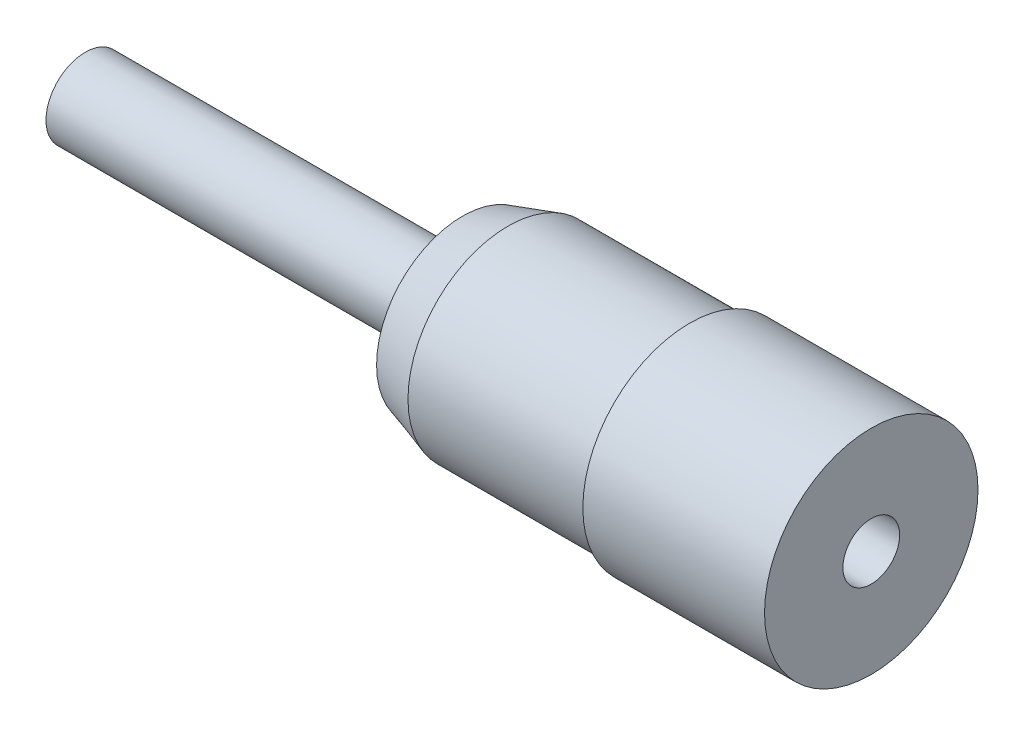
ISO-10303-21;
HEADER;
FILE_DESCRIPTION(('STEP AP214'),'2;1');
FILE_NAME('part.step','',(''),(''),'','','');
FILE_SCHEMA(('AUTOMOTIVE_DESIGN { 1 0 10303 214 1 1 1 1 }'));
ENDSEC;
DATA;
#1=APPLICATION_CONTEXT('core data for automotive mechanical design processes');
#2=APPLICATION_PROTOCOL_DEFINITION('international standard','automotive_design',2000,#1);
#3=PRODUCT_CONTEXT('',#1,'mechanical');
#4=PRODUCT('Part','Part','',(#3));
#5=PRODUCT_RELATED_PRODUCT_CATEGORY('part','',(#4));
#6=PRODUCT_DEFINITION_FORMATION('','',#4);
#7=PRODUCT_DEFINITION_CONTEXT('part definition',#1,'design');
#8=PRODUCT_DEFINITION('design','',#6,#7);
#9=PRODUCT_DEFINITION_SHAPE('','',#8);
#10=(LENGTH_UNIT() NAMED_UNIT(*) SI_UNIT(.MILLI.,.METRE.));
#11=(NAMED_UNIT(*) PLANE_ANGLE_UNIT() SI_UNIT($,.RADIAN.));
#12=(NAMED_UNIT(*) SI_UNIT($,.STERADIAN.) SOLID_ANGLE_UNIT());
#13=UNCERTAINTY_MEASURE_WITH_UNIT(LENGTH_MEASURE(1.E-05),#10,'distance_accuracy_value','');
#14=(GEOMETRIC_REPRESENTATION_CONTEXT(3) GLOBAL_UNCERTAINTY_ASSIGNED_CONTEXT((#13)) GLOBAL_UNIT_ASSIGNED_CONTEXT((#10,
#11,#12)) REPRESENTATION_CONTEXT('',''));
#15=CARTESIAN_POINT('',(0.,0.,0.));
#16=DIRECTION('',(0.,0.,1.));
#17=DIRECTION('',(1.,0.,0.));
#18=AXIS2_PLACEMENT_3D('',#15,#16,#17);
#19=CARTESIAN_POINT('',(277.446915198027,0.,0.));
#20=DIRECTION('',(-1.,0.,0.));
#21=DIRECTION('',(0.,0.,1.));
#22=AXIS2_PLACEMENT_3D('',#19,#20,#21);
#23=PLANE('',#22);
#24=CARTESIAN_POINT('',(277.446915198027,76.7068519283227,0.));
#25=DIRECTION('',(-1.,0.,0.));
#26=DIRECTION('',(0.,0.,1.));
#27=AXIS2_PLACEMENT_3D('',#24,#25,#26);
#28=CIRCLE('',#27,1.73);
#29=CARTESIAN_POINT('',(277.446915198027,76.7068519283227,1.73));
#30=VERTEX_POINT('',#29);
#31=EDGE_CURVE('E58',#30,#30,#28,.T.);
#32=ORIENTED_EDGE('',*,*,#31,.T.);
#33=EDGE_LOOP('',(#32));
#34=FACE_BOUND('',#33,.T.);
#35=ADVANCED_FACE('F39',(#34),#23,.T.);
#36=CARTESIAN_POINT('',(312.055680528163,0.,0.));
#37=DIRECTION('',(1.,0.,0.));
#38=DIRECTION('',(0.,0.,-1.));
#39=AXIS2_PLACEMENT_3D('',#36,#37,#38);
#40=PLANE('',#39);
#41=CARTESIAN_POINT('',(312.055680528163,76.7068519283227,0.));
#42=DIRECTION('',(1.,0.,0.));
#43=DIRECTION('',(0.,0.,-1.));
#44=AXIS2_PLACEMENT_3D('',#41,#42,#43);
#45=CIRCLE('',#44,1.25);
#46=CARTESIAN_POINT('',(312.055680528163,76.7068519283227,-1.25));
#47=VERTEX_POINT('',#46);
#48=EDGE_CURVE('E59',#47,#47,#45,.T.);
#49=ORIENTED_EDGE('',*,*,#48,.F.);
#50=EDGE_LOOP('',(#49));
#51=FACE_BOUND('',#50,.T.);
#52=CARTESIAN_POINT('',(312.055680528163,76.7068519283227,0.));
#53=DIRECTION('',(-1.,0.,0.));
#54=DIRECTION('',(0.,0.,1.));
#55=AXIS2_PLACEMENT_3D('',#52,#53,#54);
#56=CIRCLE('',#55,4.7);
#57=CARTESIAN_POINT('',(312.055680528163,76.7068519283227,4.7));
#58=VERTEX_POINT('',#57);
#59=EDGE_CURVE('E11',#58,#58,#56,.T.);
#60=ORIENTED_EDGE('',*,*,#59,.F.);
#61=EDGE_LOOP('',(#60));
#62=FACE_BOUND('',#61,.T.);
#63=ADVANCED_FACE('F100',(#51,#62),#40,.T.);
#64=CARTESIAN_POINT('',(277.446915198027,76.7068519283227,0.));
#65=DIRECTION('',(-1.,0.,0.));
#66=DIRECTION('',(0.,0.,1.));
#67=AXIS2_PLACEMENT_3D('',#64,#65,#66);
#68=CYLINDRICAL_SURFACE('',#67,4.70000000000001);
#69=ORIENTED_EDGE('',*,*,#59,.T.);
#70=EDGE_LOOP('',(#69));
#71=FACE_BOUND('',#70,.T.);
#72=CARTESIAN_POINT('',(304.055680528163,76.7068519283227,0.));
#73=DIRECTION('',(-1.,0.,0.));
#74=DIRECTION('',(0.,0.,1.));
#75=AXIS2_PLACEMENT_3D('',#72,#73,#74);
#76=CIRCLE('',#75,4.70000000000002);
#77=CARTESIAN_POINT('',(304.055680528163,76.7068519283227,4.70000000000002));
#78=VERTEX_POINT('',#77);
#79=EDGE_CURVE('E45',#78,#78,#76,.T.);
#80=ORIENTED_EDGE('',*,*,#79,.F.);
#81=EDGE_LOOP('',(#80));
#82=FACE_BOUND('',#81,.T.);
#83=ADVANCED_FACE('F98',(#71,#82),#68,.T.);
#84=CARTESIAN_POINT('',(303.855680528163,76.7068519283227,0.));
#85=DIRECTION('',(1.,0.,0.));
#86=DIRECTION('',(0.,0.,-1.));
#87=AXIS2_PLACEMENT_3D('',#84,#85,#86);
#88=CONICAL_SURFACE('',#87,4.4,0.982793723247414);
#89=ORIENTED_EDGE('',*,*,#79,.T.);
#90=EDGE_LOOP('',(#89));
#91=FACE_BOUND('',#90,.T.);
#92=CARTESIAN_POINT('',(303.855680528163,76.7068519283227,0.));
#93=DIRECTION('',(-1.,0.,0.));
#94=DIRECTION('',(0.,0.,1.));
#95=AXIS2_PLACEMENT_3D('',#92,#93,#94);
#96=CIRCLE('',#95,4.4);
#97=CARTESIAN_POINT('',(303.855680528163,76.7068519283227,4.4));
#98=VERTEX_POINT('',#97);
#99=EDGE_CURVE('E90',#98,#98,#96,.T.);
#100=ORIENTED_EDGE('',*,*,#99,.F.);
#101=EDGE_LOOP('',(#100));
#102=FACE_BOUND('',#101,.T.);
#103=ADVANCED_FACE('F95',(#91,#102),#88,.T.);
#104=CARTESIAN_POINT('',(277.446915198027,76.7068519283227,0.));
#105=DIRECTION('',(-1.,0.,0.));
#106=DIRECTION('',(0.,0.,1.));
#107=AXIS2_PLACEMENT_3D('',#104,#105,#106);
#108=CYLINDRICAL_SURFACE('',#107,4.4);
#109=ORIENTED_EDGE('',*,*,#99,.T.);
#110=EDGE_LOOP('',(#109));
#111=FACE_BOUND('',#110,.T.);
#112=CARTESIAN_POINT('',(296.055680528163,76.7068519283227,0.));
#113=DIRECTION('',(-1.,0.,0.));
#114=DIRECTION('',(0.,0.,1.));
#115=AXIS2_PLACEMENT_3D('',#112,#113,#114);
#116=CIRCLE('',#115,4.4);
#117=CARTESIAN_POINT('',(296.055680528163,76.7068519283227,4.4));
#118=VERTEX_POINT('',#117);
#119=EDGE_CURVE('E87',#118,#118,#116,.T.);
#120=ORIENTED_EDGE('',*,*,#119,.F.);
#121=EDGE_LOOP('',(#120));
#122=FACE_BOUND('',#121,.T.);
#123=ADVANCED_FACE('F107',(#111,#122),#108,.T.);
#124=CARTESIAN_POINT('',(296.055680528163,76.7068519283227,0.));
#125=DIRECTION('',(1.,0.,0.));
#126=DIRECTION('',(0.,0.,-1.));
#127=AXIS2_PLACEMENT_3D('',#124,#125,#126);
#128=CONICAL_SURFACE('',#127,4.4,0.29973289233041);
#129=CARTESIAN_POINT('',(294.055680528163,76.7068519283227,0.));
#130=DIRECTION('',(-1.,0.,0.));
#131=DIRECTION('',(0.,0.,1.));
#132=AXIS2_PLACEMENT_3D('',#129,#130,#131);
#133=CIRCLE('',#132,3.78191278626036);
#134=CARTESIAN_POINT('',(294.055680528163,76.7068519283227,3.78191278626036));
#135=VERTEX_POINT('',#134);
#136=EDGE_CURVE('E84',#135,#135,#133,.T.);
#137=ORIENTED_EDGE('',*,*,#136,.F.);
#138=EDGE_LOOP('',(#137));
#139=FACE_BOUND('',#138,.T.);
#140=ORIENTED_EDGE('',*,*,#119,.T.);
#141=EDGE_LOOP('',(#140));
#142=FACE_BOUND('',#141,.T.);
#143=ADVANCED_FACE('F146',(#139,#142),#128,.T.);
#144=CARTESIAN_POINT('',(294.055680528163,0.,0.));
#145=DIRECTION('',(1.,0.,0.));
#146=DIRECTION('',(0.,0.,-1.));
#147=AXIS2_PLACEMENT_3D('',#144,#145,#146);
#148=PLANE('',#147);
#149=CARTESIAN_POINT('',(294.055680528163,76.7068519283227,0.));
#150=DIRECTION('',(-1.,0.,0.));
#151=DIRECTION('',(0.,0.,1.));
#152=AXIS2_PLACEMENT_3D('',#149,#150,#151);
#153=CIRCLE('',#152,3.46791323915042);
#154=CARTESIAN_POINT('',(294.055680528163,76.7068519283227,3.46791323915042));
#155=VERTEX_POINT('',#154);
#156=EDGE_CURVE('E81',#155,#155,#153,.T.);
#157=ORIENTED_EDGE('',*,*,#156,.F.);
#158=EDGE_LOOP('',(#157));
#159=FACE_BOUND('',#158,.T.);
#160=ORIENTED_EDGE('',*,*,#136,.T.);
#161=EDGE_LOOP('',(#160));
#162=FACE_BOUND('',#161,.T.);
#163=ADVANCED_FACE('F142',(#159,#162),#148,.F.);
#164=CARTESIAN_POINT('',(296.100980113072,76.7068519283227,0.));
#165=DIRECTION('',(1.,0.,0.));
#166=DIRECTION('',(0.,0.,-1.));
#167=AXIS2_PLACEMENT_3D('',#164,#165,#166);
#168=CONICAL_SURFACE('',#167,4.10000000000001,0.299732892330405);
#169=ORIENTED_EDGE('',*,*,#156,.T.);
#170=EDGE_LOOP('',(#169));
#171=FACE_BOUND('',#170,.T.);
#172=CARTESIAN_POINT('',(296.100980113072,76.7068519283227,0.));
#173=DIRECTION('',(-1.,0.,0.));
#174=DIRECTION('',(0.,0.,1.));
#175=AXIS2_PLACEMENT_3D('',#172,#173,#174);
#176=CIRCLE('',#175,4.10000000000001);
#177=CARTESIAN_POINT('',(296.100980113072,76.7068519283227,4.10000000000001));
#178=VERTEX_POINT('',#177);
#179=EDGE_CURVE('E78',#178,#178,#176,.T.);
#180=ORIENTED_EDGE('',*,*,#179,.F.);
#181=EDGE_LOOP('',(#180));
#182=FACE_BOUND('',#181,.T.);
#183=ADVANCED_FACE('F138',(#171,#182),#168,.F.);
#184=CARTESIAN_POINT('',(277.446915198027,76.7068519283227,0.));
#185=DIRECTION('',(-1.,0.,0.));
#186=DIRECTION('',(0.,0.,1.));
#187=AXIS2_PLACEMENT_3D('',#184,#185,#186);
#188=CYLINDRICAL_SURFACE('',#187,4.10000000000001);
#189=CARTESIAN_POINT('',(304.01623565571,76.7068519283227,0.));
#190=DIRECTION('',(-1.,0.,0.));
#191=DIRECTION('',(0.,0.,1.));
#192=AXIS2_PLACEMENT_3D('',#189,#190,#191);
#193=CIRCLE('',#192,4.10000000000001);
#194=CARTESIAN_POINT('',(304.01623565571,76.7068519283227,4.10000000000001));
#195=VERTEX_POINT('',#194);
#196=EDGE_CURVE('E75',#195,#195,#193,.T.);
#197=ORIENTED_EDGE('',*,*,#196,.F.);
#198=EDGE_LOOP('',(#197));
#199=FACE_BOUND('',#198,.T.);
#200=ORIENTED_EDGE('',*,*,#179,.T.);
#201=EDGE_LOOP('',(#200));
#202=FACE_BOUND('',#201,.T.);
#203=ADVANCED_FACE('F134',(#199,#202),#188,.F.);
#204=CARTESIAN_POINT('',(304.01623565571,76.7068519283227,0.));
#205=DIRECTION('',(1.,0.,0.));
#206=DIRECTION('',(0.,0.,-1.));
#207=AXIS2_PLACEMENT_3D('',#204,#205,#206);
#208=CONICAL_SURFACE('',#207,4.10000000000001,0.982793723247372);
#209=CARTESIAN_POINT('',(304.21623565571,76.7068519283227,0.));
#210=DIRECTION('',(-1.,0.,0.));
#211=DIRECTION('',(0.,0.,1.));
#212=AXIS2_PLACEMENT_3D('',#209,#210,#211);
#213=CIRCLE('',#212,4.4);
#214=CARTESIAN_POINT('',(304.21623565571,76.7068519283227,4.4));
#215=VERTEX_POINT('',#214);
#216=EDGE_CURVE('E72',#215,#215,#213,.T.);
#217=ORIENTED_EDGE('',*,*,#216,.F.);
#218=EDGE_LOOP('',(#217));
#219=FACE_BOUND('',#218,.T.);
#220=ORIENTED_EDGE('',*,*,#196,.T.);
#221=EDGE_LOOP('',(#220));
#222=FACE_BOUND('',#221,.T.);
#223=ADVANCED_FACE('F130',(#219,#222),#208,.F.);
#224=CARTESIAN_POINT('',(277.446915198027,76.7068519283227,0.));
#225=DIRECTION('',(-1.,0.,0.));
#226=DIRECTION('',(0.,0.,1.));
#227=AXIS2_PLACEMENT_3D('',#224,#225,#226);
#228=CYLINDRICAL_SURFACE('',#227,4.40000000000001);
#229=CARTESIAN_POINT('',(309.446915198027,76.7068519283227,0.));
#230=DIRECTION('',(-1.,0.,0.));
#231=DIRECTION('',(0.,0.,1.));
#232=AXIS2_PLACEMENT_3D('',#229,#230,#231);
#233=CIRCLE('',#232,4.40000000000001);
#234=CARTESIAN_POINT('',(309.446915198027,76.7068519283227,4.40000000000001));
#235=VERTEX_POINT('',#234);
#236=EDGE_CURVE('E69',#235,#235,#233,.T.);
#237=ORIENTED_EDGE('',*,*,#236,.F.);
#238=EDGE_LOOP('',(#237));
#239=FACE_BOUND('',#238,.T.);
#240=ORIENTED_EDGE('',*,*,#216,.T.);
#241=EDGE_LOOP('',(#240));
#242=FACE_BOUND('',#241,.T.);
#243=ADVANCED_FACE('F123',(#239,#242),#228,.F.);
#244=CARTESIAN_POINT('',(309.446915198027,0.,0.));
#245=DIRECTION('',(-1.,0.,0.));
#246=DIRECTION('',(0.,0.,1.));
#247=AXIS2_PLACEMENT_3D('',#244,#245,#246);
#248=PLANE('',#247);
#249=ORIENTED_EDGE('',*,*,#236,.T.);
#250=EDGE_LOOP('',(#249));
#251=FACE_BOUND('',#250,.T.);
#252=CARTESIAN_POINT('',(309.446915198027,76.7068519283227,0.));
#253=DIRECTION('',(-1.,0.,0.));
#254=DIRECTION('',(0.,0.,1.));
#255=AXIS2_PLACEMENT_3D('',#252,#253,#254);
#256=CIRCLE('',#255,1.73);
#257=CARTESIAN_POINT('',(309.446915198027,76.7068519283227,1.73));
#258=VERTEX_POINT('',#257);
#259=EDGE_CURVE('E62',#258,#258,#256,.T.);
#260=ORIENTED_EDGE('',*,*,#259,.F.);
#261=EDGE_LOOP('',(#260));
#262=FACE_BOUND('',#261,.T.);
#263=ADVANCED_FACE('F117',(#251,#262),#248,.T.);
#264=CARTESIAN_POINT('',(277.446915198027,76.7068519283227,0.));
#265=DIRECTION('',(-1.,0.,0.));
#266=DIRECTION('',(0.,0.,1.));
#267=AXIS2_PLACEMENT_3D('',#264,#265,#266);
#268=CYLINDRICAL_SURFACE('',#267,1.73);
#269=ORIENTED_EDGE('',*,*,#259,.T.);
#270=EDGE_LOOP('',(#269));
#271=FACE_BOUND('',#270,.T.);
#272=ORIENTED_EDGE('',*,*,#31,.F.);
#273=EDGE_LOOP('',(#272));
#274=FACE_BOUND('',#273,.T.);
#275=ADVANCED_FACE('F52',(#271,#274),#268,.T.);
#276=CARTESIAN_POINT('',(306.555680528163,76.7068519283227,0.));
#277=DIRECTION('',(1.,0.,0.));
#278=DIRECTION('',(0.,0.,-1.));
#279=AXIS2_PLACEMENT_3D('',#276,#277,#278);
#280=CONICAL_SURFACE('',#279,1.25,1.02974425867668);
#281=CARTESIAN_POINT('',(305.804604754379,76.7068519283227,0.));
#282=VERTEX_POINT('',#281);
#283=VERTEX_LOOP('',#282);
#284=FACE_BOUND('',#283,.T.);
#285=CARTESIAN_POINT('',(306.555680528163,76.7068519283227,0.));
#286=DIRECTION('',(1.,0.,0.));
#287=DIRECTION('',(0.,0.,-1.));
#288=AXIS2_PLACEMENT_3D('',#285,#286,#287);
#289=CIRCLE('',#288,1.25);
#290=CARTESIAN_POINT('',(306.555680528163,76.7068519283227,-1.25));
#291=VERTEX_POINT('',#290);
#292=EDGE_CURVE('E56',#291,#291,#289,.T.);
#293=ORIENTED_EDGE('',*,*,#292,.T.);
#294=EDGE_LOOP('',(#293));
#295=FACE_BOUND('',#294,.T.);
#296=ADVANCED_FACE('F48',(#284,#295),#280,.F.);
#297=CARTESIAN_POINT('',(312.055680528163,76.7068519283227,0.));
#298=DIRECTION('',(1.,0.,0.));
#299=DIRECTION('',(0.,0.,-1.));
#300=AXIS2_PLACEMENT_3D('',#297,#298,#299);
#301=CYLINDRICAL_SURFACE('',#300,1.25);
#302=ORIENTED_EDGE('',*,*,#292,.F.);
#303=EDGE_LOOP('',(#302));
#304=FACE_BOUND('',#303,.T.);
#305=ORIENTED_EDGE('',*,*,#48,.T.);
#306=EDGE_LOOP('',(#305));
#307=FACE_BOUND('',#306,.T.);
#308=ADVANCED_FACE('F51',(#304,#307),#301,.F.);
#309=CLOSED_SHELL('',(#35,#63,#83,#103,#123,#143,#163,#183,#203,#223,#243,#263,#275,#296,#308));
#310=MANIFOLD_SOLID_BREP('B2',#309);
#311=ADVANCED_BREP_SHAPE_REPRESENTATION('',(#18,#310),#14);
#312=SHAPE_DEFINITION_REPRESENTATION(#9,#311);
ENDSEC;
END-ISO-10303-21;
